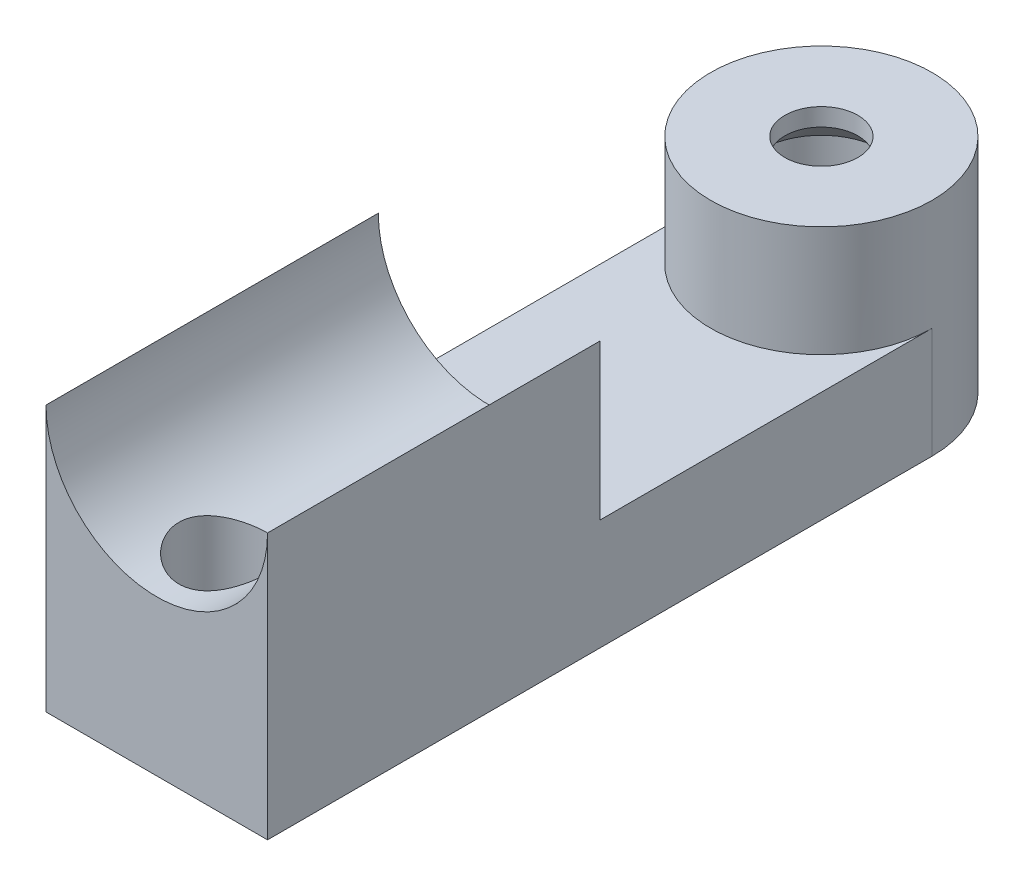
ISO-10303-21;
HEADER;
FILE_DESCRIPTION(('STEP AP214'),'2;1');
FILE_NAME('part.step','',(''),(''),'','','');
FILE_SCHEMA(('AUTOMOTIVE_DESIGN { 1 0 10303 214 1 1 1 1 }'));
ENDSEC;
DATA;
#1=APPLICATION_CONTEXT('core data for automotive mechanical design processes');
#2=APPLICATION_PROTOCOL_DEFINITION('international standard','automotive_design',2000,#1);
#3=PRODUCT_CONTEXT('',#1,'mechanical');
#4=PRODUCT('Part','Part','',(#3));
#5=PRODUCT_RELATED_PRODUCT_CATEGORY('part','',(#4));
#6=PRODUCT_DEFINITION_FORMATION('','',#4);
#7=PRODUCT_DEFINITION_CONTEXT('part definition',#1,'design');
#8=PRODUCT_DEFINITION('design','',#6,#7);
#9=PRODUCT_DEFINITION_SHAPE('','',#8);
#10=(LENGTH_UNIT() NAMED_UNIT(*) SI_UNIT(.MILLI.,.METRE.));
#11=(NAMED_UNIT(*) PLANE_ANGLE_UNIT() SI_UNIT($,.RADIAN.));
#12=(NAMED_UNIT(*) SI_UNIT($,.STERADIAN.) SOLID_ANGLE_UNIT());
#13=UNCERTAINTY_MEASURE_WITH_UNIT(LENGTH_MEASURE(1.E-05),#10,'distance_accuracy_value','');
#14=(GEOMETRIC_REPRESENTATION_CONTEXT(3) GLOBAL_UNCERTAINTY_ASSIGNED_CONTEXT((#13)) GLOBAL_UNIT_ASSIGNED_CONTEXT((#10,
#11,#12)) REPRESENTATION_CONTEXT('',''));
#15=CARTESIAN_POINT('',(0.,0.,0.));
#16=DIRECTION('',(0.,0.,1.));
#17=DIRECTION('',(1.,0.,0.));
#18=AXIS2_PLACEMENT_3D('',#15,#16,#17);
#19=CARTESIAN_POINT('',(0.,5.,0.));
#20=DIRECTION('',(0.,-1.,0.));
#21=DIRECTION('',(0.,0.,-1.));
#22=AXIS2_PLACEMENT_3D('',#19,#20,#21);
#23=CYLINDRICAL_SURFACE('',#22,1.65);
#24=CARTESIAN_POINT('',(0.,4.20000000000002,0.));
#25=DIRECTION('',(0.,-1.,0.));
#26=DIRECTION('',(0.,0.,-1.));
#27=AXIS2_PLACEMENT_3D('',#24,#25,#26);
#28=CIRCLE('',#27,1.65);
#29=CARTESIAN_POINT('',(0.,4.20000000000002,-1.65));
#30=VERTEX_POINT('',#29);
#31=EDGE_CURVE('E56',#30,#30,#28,.T.);
#32=ORIENTED_EDGE('',*,*,#31,.T.);
#33=EDGE_LOOP('',(#32));
#34=FACE_BOUND('',#33,.T.);
#35=CARTESIAN_POINT('',(0.,5.,0.));
#36=DIRECTION('',(0.,1.,0.));
#37=DIRECTION('',(0.,0.,1.));
#38=AXIS2_PLACEMENT_3D('',#35,#36,#37);
#39=CIRCLE('',#38,1.65);
#40=CARTESIAN_POINT('',(0.,5.,1.65));
#41=VERTEX_POINT('',#40);
#42=EDGE_CURVE('E136',#41,#41,#39,.T.);
#43=ORIENTED_EDGE('',*,*,#42,.T.);
#44=EDGE_LOOP('',(#43));
#45=FACE_BOUND('',#44,.T.);
#46=ADVANCED_FACE('F47',(#34,#45),#23,.F.);
#47=CARTESIAN_POINT('',(0.,0.,0.));
#48=DIRECTION('',(0.,-1.,0.));
#49=DIRECTION('',(0.,0.,-1.));
#50=AXIS2_PLACEMENT_3D('',#47,#48,#49);
#51=PLANE('',#50);
#52=DIRECTION('',(-1.,0.,0.));
#53=VECTOR('',#52,1.);
#54=CARTESIAN_POINT('',(0.,0.,15.));
#55=LINE('',#54,#53);
#56=CARTESIAN_POINT('',(5.,0.,15.));
#57=VERTEX_POINT('',#56);
#58=CARTESIAN_POINT('',(-5.,0.,15.));
#59=VERTEX_POINT('',#58);
#60=EDGE_CURVE('E94',#57,#59,#55,.T.);
#61=ORIENTED_EDGE('',*,*,#60,.F.);
#62=DIRECTION('',(0.,0.,1.));
#63=VECTOR('',#62,1.);
#64=CARTESIAN_POINT('',(5.,0.,30.));
#65=LINE('',#64,#63);
#66=CARTESIAN_POINT('',(5.,0.,0.));
#67=VERTEX_POINT('',#66);
#68=EDGE_CURVE('E128',#67,#57,#65,.T.);
#69=ORIENTED_EDGE('',*,*,#68,.F.);
#70=CARTESIAN_POINT('',(0.,0.,0.));
#71=DIRECTION('',(0.,1.,0.));
#72=DIRECTION('',(0.,0.,1.));
#73=AXIS2_PLACEMENT_3D('',#70,#71,#72);
#74=CIRCLE('',#73,5.);
#75=CARTESIAN_POINT('',(-5.,0.,0.));
#76=VERTEX_POINT('',#75);
#77=EDGE_CURVE('E139',#76,#67,#74,.T.);
#78=ORIENTED_EDGE('',*,*,#77,.F.);
#79=DIRECTION('',(0.,0.,-1.));
#80=VECTOR('',#79,1.);
#81=CARTESIAN_POINT('',(-5.,0.,0.));
#82=LINE('',#81,#80);
#83=EDGE_CURVE('E84',#59,#76,#82,.T.);
#84=ORIENTED_EDGE('',*,*,#83,.F.);
#85=EDGE_LOOP('',(#61,#69,#78,#84));
#86=FACE_BOUND('',#85,.T.);
#87=ADVANCED_FACE('F177',(#86),#51,.F.);
#88=CARTESIAN_POINT('',(0.,5.,0.));
#89=DIRECTION('',(0.,1.,0.));
#90=DIRECTION('',(0.,0.,1.));
#91=AXIS2_PLACEMENT_3D('',#88,#89,#90);
#92=PLANE('',#91);
#93=CARTESIAN_POINT('',(0.,5.,0.));
#94=DIRECTION('',(0.,1.,0.));
#95=DIRECTION('',(0.,0.,1.));
#96=AXIS2_PLACEMENT_3D('',#93,#94,#95);
#97=CIRCLE('',#96,5.);
#98=CARTESIAN_POINT('',(0.,5.,5.));
#99=VERTEX_POINT('',#98);
#100=EDGE_CURVE('E140',#99,#99,#97,.T.);
#101=ORIENTED_EDGE('',*,*,#100,.T.);
#102=EDGE_LOOP('',(#101));
#103=FACE_BOUND('',#102,.T.);
#104=ORIENTED_EDGE('',*,*,#42,.F.);
#105=EDGE_LOOP('',(#104));
#106=FACE_BOUND('',#105,.T.);
#107=ADVANCED_FACE('F184',(#103,#106),#92,.T.);
#108=CARTESIAN_POINT('',(0.,5.,0.));
#109=DIRECTION('',(0.,-1.,0.));
#110=DIRECTION('',(0.,0.,-1.));
#111=AXIS2_PLACEMENT_3D('',#108,#109,#110);
#112=CYLINDRICAL_SURFACE('',#111,5.);
#113=ORIENTED_EDGE('',*,*,#100,.F.);
#114=EDGE_LOOP('',(#113));
#115=FACE_BOUND('',#114,.T.);
#116=ORIENTED_EDGE('',*,*,#77,.T.);
#117=DIRECTION('',(0.,1.,0.));
#118=VECTOR('',#117,1.);
#119=CARTESIAN_POINT('',(5.,-5.,0.));
#120=LINE('',#119,#118);
#121=CARTESIAN_POINT('',(5.,-5.,0.));
#122=VERTEX_POINT('',#121);
#123=EDGE_CURVE('E63',#122,#67,#120,.T.);
#124=ORIENTED_EDGE('',*,*,#123,.F.);
#125=CARTESIAN_POINT('',(0.,-5.,0.));
#126=DIRECTION('',(0.,-1.,0.));
#127=DIRECTION('',(0.,0.,-1.));
#128=AXIS2_PLACEMENT_3D('',#125,#126,#127);
#129=CIRCLE('',#128,5.);
#130=CARTESIAN_POINT('',(-5.,-5.,0.));
#131=VERTEX_POINT('',#130);
#132=EDGE_CURVE('E106',#131,#122,#129,.T.);
#133=ORIENTED_EDGE('',*,*,#132,.F.);
#134=DIRECTION('',(0.,1.,0.));
#135=VECTOR('',#134,1.);
#136=CARTESIAN_POINT('',(-5.,-5.,0.));
#137=LINE('',#136,#135);
#138=EDGE_CURVE('E124',#131,#76,#137,.T.);
#139=ORIENTED_EDGE('',*,*,#138,.T.);
#140=EDGE_LOOP('',(#116,#124,#133,#139));
#141=FACE_BOUND('',#140,.T.);
#142=ADVANCED_FACE('F193',(#115,#141),#112,.T.);
#143=CARTESIAN_POINT('',(5.,-5.,30.));
#144=DIRECTION('',(-1.,0.,0.));
#145=DIRECTION('',(0.,0.,1.));
#146=AXIS2_PLACEMENT_3D('',#143,#144,#145);
#147=PLANE('',#146);
#148=DIRECTION('',(0.,1.,0.));
#149=VECTOR('',#148,1.);
#150=CARTESIAN_POINT('',(5.,-5.,30.));
#151=LINE('',#150,#149);
#152=CARTESIAN_POINT('',(5.,-5.,30.));
#153=VERTEX_POINT('',#152);
#154=CARTESIAN_POINT('',(5.,7.00000000000005,30.));
#155=VERTEX_POINT('',#154);
#156=EDGE_CURVE('E110',#153,#155,#151,.T.);
#157=ORIENTED_EDGE('',*,*,#156,.F.);
#158=DIRECTION('',(0.,0.,1.));
#159=VECTOR('',#158,1.);
#160=CARTESIAN_POINT('',(5.,-5.,30.));
#161=LINE('',#160,#159);
#162=EDGE_CURVE('E99',#122,#153,#161,.T.);
#163=ORIENTED_EDGE('',*,*,#162,.F.);
#164=ORIENTED_EDGE('',*,*,#123,.T.);
#165=ORIENTED_EDGE('',*,*,#68,.T.);
#166=DIRECTION('',(0.,1.,0.));
#167=VECTOR('',#166,1.);
#168=CARTESIAN_POINT('',(5.,-5.,15.));
#169=LINE('',#168,#167);
#170=CARTESIAN_POINT('',(5.,7.00000000000005,15.));
#171=VERTEX_POINT('',#170);
#172=EDGE_CURVE('E204',#57,#171,#169,.T.);
#173=ORIENTED_EDGE('',*,*,#172,.T.);
#174=DIRECTION('',(0.,0.,1.));
#175=VECTOR('',#174,1.);
#176=CARTESIAN_POINT('',(5.,7.00000000000005,15.));
#177=LINE('',#176,#175);
#178=EDGE_CURVE('E115',#171,#155,#177,.T.);
#179=ORIENTED_EDGE('',*,*,#178,.T.);
#180=EDGE_LOOP('',(#157,#163,#164,#165,#173,#179));
#181=FACE_BOUND('',#180,.T.);
#182=ADVANCED_FACE('F111',(#181),#147,.F.);
#183=CARTESIAN_POINT('',(-5.,-5.,30.));
#184=DIRECTION('',(0.,0.,-1.));
#185=DIRECTION('',(-1.,0.,0.));
#186=AXIS2_PLACEMENT_3D('',#183,#184,#185);
#187=PLANE('',#186);
#188=ORIENTED_EDGE('',*,*,#156,.T.);
#189=CARTESIAN_POINT('',(0.,7.00000000000002,30.));
#190=DIRECTION('',(0.,0.,-1.));
#191=DIRECTION('',(1.,0.,0.));
#192=AXIS2_PLACEMENT_3D('',#189,#190,#191);
#193=CIRCLE('',#192,4.99999999999996);
#194=CARTESIAN_POINT('',(-4.99999999999998,7.00000000000005,30.));
#195=VERTEX_POINT('',#194);
#196=EDGE_CURVE('E153',#155,#195,#193,.T.);
#197=ORIENTED_EDGE('',*,*,#196,.T.);
#198=DIRECTION('',(0.,1.,0.));
#199=VECTOR('',#198,1.);
#200=CARTESIAN_POINT('',(-5.,-5.,30.));
#201=LINE('',#200,#199);
#202=CARTESIAN_POINT('',(-5.,-5.,30.));
#203=VERTEX_POINT('',#202);
#204=EDGE_CURVE('E119',#203,#195,#201,.T.);
#205=ORIENTED_EDGE('',*,*,#204,.F.);
#206=DIRECTION('',(-1.,0.,0.));
#207=VECTOR('',#206,1.);
#208=CARTESIAN_POINT('',(-5.,-5.,30.));
#209=LINE('',#208,#207);
#210=EDGE_CURVE('E103',#153,#203,#209,.T.);
#211=ORIENTED_EDGE('',*,*,#210,.F.);
#212=EDGE_LOOP('',(#188,#197,#205,#211));
#213=FACE_BOUND('',#212,.T.);
#214=ADVANCED_FACE('F121',(#213),#187,.F.);
#215=CARTESIAN_POINT('',(-5.,-5.,0.));
#216=DIRECTION('',(1.,0.,0.));
#217=DIRECTION('',(0.,0.,-1.));
#218=AXIS2_PLACEMENT_3D('',#215,#216,#217);
#219=PLANE('',#218);
#220=ORIENTED_EDGE('',*,*,#204,.T.);
#221=DIRECTION('',(0.,0.,1.));
#222=VECTOR('',#221,1.);
#223=CARTESIAN_POINT('',(-4.99999999999998,7.00000000000005,15.));
#224=LINE('',#223,#222);
#225=CARTESIAN_POINT('',(-4.99999999999998,7.00000000000005,15.));
#226=VERTEX_POINT('',#225);
#227=EDGE_CURVE('E130',#226,#195,#224,.T.);
#228=ORIENTED_EDGE('',*,*,#227,.F.);
#229=DIRECTION('',(0.,-1.,0.));
#230=VECTOR('',#229,1.);
#231=CARTESIAN_POINT('',(-5.,0.,15.));
#232=LINE('',#231,#230);
#233=EDGE_CURVE('E213',#226,#59,#232,.T.);
#234=ORIENTED_EDGE('',*,*,#233,.T.);
#235=ORIENTED_EDGE('',*,*,#83,.T.);
#236=ORIENTED_EDGE('',*,*,#138,.F.);
#237=DIRECTION('',(0.,0.,-1.));
#238=VECTOR('',#237,1.);
#239=CARTESIAN_POINT('',(-5.,-5.,0.));
#240=LINE('',#239,#238);
#241=EDGE_CURVE('E72',#203,#131,#240,.T.);
#242=ORIENTED_EDGE('',*,*,#241,.F.);
#243=EDGE_LOOP('',(#220,#228,#234,#235,#236,#242));
#244=FACE_BOUND('',#243,.T.);
#245=ADVANCED_FACE('F174',(#244),#219,.F.);
#246=CARTESIAN_POINT('',(0.,-5.,0.));
#247=DIRECTION('',(0.,-1.,0.));
#248=DIRECTION('',(0.,0.,-1.));
#249=AXIS2_PLACEMENT_3D('',#246,#247,#248);
#250=PLANE('',#249);
#251=CARTESIAN_POINT('',(0.,-5.,0.));
#252=DIRECTION('',(0.,-1.,0.));
#253=DIRECTION('',(0.,0.,-1.));
#254=AXIS2_PLACEMENT_3D('',#251,#252,#253);
#255=CIRCLE('',#254,2.75);
#256=CARTESIAN_POINT('',(0.,-5.,-2.75));
#257=VERTEX_POINT('',#256);
#258=EDGE_CURVE('E388',#257,#257,#255,.T.);
#259=ORIENTED_EDGE('',*,*,#258,.F.);
#260=EDGE_LOOP('',(#259));
#261=FACE_BOUND('',#260,.T.);
#262=ORIENTED_EDGE('',*,*,#241,.T.);
#263=ORIENTED_EDGE('',*,*,#132,.T.);
#264=ORIENTED_EDGE('',*,*,#162,.T.);
#265=ORIENTED_EDGE('',*,*,#210,.T.);
#266=EDGE_LOOP('',(#262,#263,#264,#265));
#267=FACE_BOUND('',#266,.T.);
#268=ADVANCED_FACE('F101',(#261,#267),#250,.T.);
#269=CARTESIAN_POINT('',(0.,7.00000000000002,15.));
#270=DIRECTION('',(0.,0.,1.));
#271=DIRECTION('',(1.,0.,0.));
#272=AXIS2_PLACEMENT_3D('',#269,#270,#271);
#273=PLANE('',#272);
#274=ORIENTED_EDGE('',*,*,#172,.F.);
#275=ORIENTED_EDGE('',*,*,#60,.T.);
#276=ORIENTED_EDGE('',*,*,#233,.F.);
#277=CARTESIAN_POINT('',(0.,7.00000000000002,15.));
#278=DIRECTION('',(0.,0.,-1.));
#279=DIRECTION('',(1.,0.,0.));
#280=AXIS2_PLACEMENT_3D('',#277,#278,#279);
#281=CIRCLE('',#280,4.99999999999996);
#282=EDGE_CURVE('E208',#171,#226,#281,.T.);
#283=ORIENTED_EDGE('',*,*,#282,.F.);
#284=EDGE_LOOP('',(#274,#275,#276,#283));
#285=FACE_BOUND('',#284,.T.);
#286=ADVANCED_FACE('F166',(#285),#273,.F.);
#287=CARTESIAN_POINT('',(0.,7.00000000000002,15.));
#288=DIRECTION('',(0.,0.,1.));
#289=DIRECTION('',(1.,0.,0.));
#290=AXIS2_PLACEMENT_3D('',#287,#288,#289);
#291=CYLINDRICAL_SURFACE('',#290,4.99999999999996);
#292=CARTESIAN_POINT('',(0.,2.00000000000005,25.));
#293=CARTESIAN_POINT('',(-0.107493005442891,2.00000728772921,25.0000098518237));
#294=CARTESIAN_POINT('',(-0.215172564090673,2.00350705693073,25.0087177520884));
#295=CARTESIAN_POINT('',(-0.427496480417896,2.01716546899364,25.0432477035212));
#296=CARTESIAN_POINT('',(-0.532131777561248,2.02734221301128,25.0691162790861));
#297=CARTESIAN_POINT('',(-0.734953922727403,2.05325790786887,25.1368760780588));
#298=CARTESIAN_POINT('',(-0.833160661616958,2.06897863635933,25.1787148462167));
#299=CARTESIAN_POINT('',(-1.02107197032837,2.10443389203927,25.2770191733265));
#300=CARTESIAN_POINT('',(-1.11077947675099,2.12416702541948,25.3334796549189));
#301=CARTESIAN_POINT('',(-1.28350100757039,2.16669113829586,25.4622354985609));
#302=CARTESIAN_POINT('',(-1.36606227255021,2.18957703070814,25.5351066562403));
#303=CARTESIAN_POINT('',(-1.51817500478472,2.2353942309381,25.6934000034768));
#304=CARTESIAN_POINT('',(-1.58772010713353,2.25832555546212,25.7788282972117));
#305=CARTESIAN_POINT('',(-1.71487456729288,2.30277208202868,25.9644280702423));
#306=CARTESIAN_POINT('',(-1.77181498119547,2.32417884035053,26.0650864860232));
#307=CARTESIAN_POINT('',(-1.86775471903715,2.36166352813212,26.27553639842));
#308=CARTESIAN_POINT('',(-1.90676256428583,2.37774398755829,26.3853235278484));
#309=CARTESIAN_POINT('',(-1.96389882339587,2.40173642339186,26.6057123335921));
#310=CARTESIAN_POINT('',(-1.98289396580565,2.409985796444,26.7160512355762));
#311=CARTESIAN_POINT('',(-2.00217296164003,2.41835995950861,26.9386349983073));
#312=CARTESIAN_POINT('',(-2.00246601631322,2.41848874477237,27.050878894625));
#313=CARTESIAN_POINT('',(-1.98498936750455,2.41089499720011,27.265756671458));
#314=CARTESIAN_POINT('',(-1.96847531430514,2.40371824961555,27.368515714409));
#315=CARTESIAN_POINT('',(-1.91994688029782,2.38323812392169,27.5696595560067));
#316=CARTESIAN_POINT('',(-1.88792979480463,2.36993367678332,27.6680435881103));
#317=CARTESIAN_POINT('',(-1.80869473255107,2.33840514911475,27.860017836196));
#318=CARTESIAN_POINT('',(-1.76117986231532,2.32008620719217,27.9534692390547));
#319=CARTESIAN_POINT('',(-1.65250646073221,2.28061883610115,28.1314158163616));
#320=CARTESIAN_POINT('',(-1.59134280510084,2.25946934543157,28.2159076094028));
#321=CARTESIAN_POINT('',(-1.45155059945443,2.21473263257734,28.380409728802));
#322=CARTESIAN_POINT('',(-1.37193746297064,2.19108335023853,28.459568729446));
#323=CARTESIAN_POINT('',(-1.20031442743019,2.14540175041723,28.603684478002));
#324=CARTESIAN_POINT('',(-1.10830206533444,2.1233697555468,28.6686383974103));
#325=CARTESIAN_POINT('',(-0.912077652605844,2.08285318735457,28.7836174474158));
#326=CARTESIAN_POINT('',(-0.807660491346479,2.0644472990459,28.8333222811971));
#327=CARTESIAN_POINT('',(-0.591023765482883,2.03385171671246,28.9141678610781));
#328=CARTESIAN_POINT('',(-0.478808196849675,2.02165886537623,28.9453180375574));
#329=CARTESIAN_POINT('',(-0.256895887607821,2.00543860493095,28.9864482954197));
#330=CARTESIAN_POINT('',(-0.147443293985536,2.00097054166491,28.9975724542536));
#331=CARTESIAN_POINT('',(0.0718453098078158,1.99931521489375,29.0017131005286));
#332=CARTESIAN_POINT('',(0.181681213223923,2.00212606417714,28.9947342815475));
#333=CARTESIAN_POINT('',(0.393432739121986,2.01442432936253,28.963708247448));
#334=CARTESIAN_POINT('',(0.495482491775473,2.02360608654482,28.940442019649));
#335=CARTESIAN_POINT('',(0.694135428060778,2.04740558594506,28.8785642916902));
#336=CARTESIAN_POINT('',(0.790737910224843,2.06202402643475,28.8399508203313));
#337=CARTESIAN_POINT('',(0.9790787858167,2.09583405229194,28.7472150603201));
#338=CARTESIAN_POINT('',(1.0705780227554,2.11515184020202,28.6926545279569));
#339=CARTESIAN_POINT('',(1.24344359124655,2.15626635254481,28.5700596760944));
#340=CARTESIAN_POINT('',(1.32480584076112,2.17806406889736,28.5020199570774));
#341=CARTESIAN_POINT('',(1.48072304302882,2.22354882361894,28.3491299870504));
#342=CARTESIAN_POINT('',(1.55447393380606,2.24726558574954,28.2634664584938));
#343=CARTESIAN_POINT('',(1.68675119741371,2.29258327082874,28.0805599169906));
#344=CARTESIAN_POINT('',(1.74527506133751,2.31418384473496,27.9833149996601));
#345=CARTESIAN_POINT('',(1.84580750193163,2.35285700092298,27.7785383054059));
#346=CARTESIAN_POINT('',(1.88765059453445,2.36988369115219,27.6709160007877));
#347=CARTESIAN_POINT('',(1.9522962197053,2.39676326522075,27.4492663482848));
#348=CARTESIAN_POINT('',(1.97511280526932,2.40662144304008,27.3352437941876));
#349=CARTESIAN_POINT('',(1.9997156172784,2.4172824070008,27.1128720982255));
#350=CARTESIAN_POINT('',(2.00289708230287,2.41868578991835,27.0047051604067));
#351=CARTESIAN_POINT('',(1.99180315927753,2.41385163966909,26.7894551422867));
#352=CARTESIAN_POINT('',(1.97752998791378,2.40761507675213,26.6823719260974));
#353=CARTESIAN_POINT('',(1.93307136615365,2.38873350920986,26.476667810145));
#354=CARTESIAN_POINT('',(1.90353749357098,2.37635168172557,26.377879725567));
#355=CARTESIAN_POINT('',(1.83000544849102,2.3467599876731,26.1866213703865));
#356=CARTESIAN_POINT('',(1.78600328139382,2.32954878794,26.0941528531002));
#357=CARTESIAN_POINT('',(1.68187276275973,2.29101390395515,25.9123903807292));
#358=CARTESIAN_POINT('',(1.62096533515949,2.26951117686764,25.8235813298695));
#359=CARTESIAN_POINT('',(1.4858921192715,2.22536195627769,25.6570066827962));
#360=CARTESIAN_POINT('',(1.41172233481813,2.202715119516,25.5792444278717));
#361=CARTESIAN_POINT('',(1.24650550627247,2.15706432912612,25.4317971467364));
#362=CARTESIAN_POINT('',(1.15467600114614,2.13413242037821,25.3629626931019));
#363=CARTESIAN_POINT('',(0.959900320285784,2.09199593286289,25.2416629573784));
#364=CARTESIAN_POINT('',(0.856949004547242,2.072793089071,25.1892052878475));
#365=CARTESIAN_POINT('',(0.644738062495208,2.04060285184144,25.1033777848097));
#366=CARTESIAN_POINT('',(0.535631618219701,2.02750636944978,25.0696706764397));
#367=CARTESIAN_POINT('',(0.312876546281225,2.0085569379064,25.0213608790457));
#368=CARTESIAN_POINT('',(0.199243525858917,2.00268100504368,25.0066975632561));
#369=CARTESIAN_POINT('',(0.0569122978909329,2.00024100495869,25.0006046190217));
#370=CARTESIAN_POINT('',(0.02846268874076,1.9999980703083,24.9999973913708));
#371=CARTESIAN_POINT('',(0.,2.00000000000005,25.));
#372=B_SPLINE_CURVE_WITH_KNOTS('',3,(#292,#293,#294,#295,#296,#297,#298,#299,#300,#301,#302,
#303,#304,#305,#306,#307,#308,#309,#310,#311,#312,#313,#314,#315,#316,#317,#318,#319,#320,#321,
#322,#323,#324,#325,#326,#327,#328,#329,#330,#331,#332,#333,#334,#335,#336,#337,#338,#339,#340,
#341,#342,#343,#344,#345,#346,#347,#348,#349,#350,#351,#352,#353,#354,#355,#356,#357,#358,#359,
#360,#361,#362,#363,#364,#365,#366,#367,#368,#369,#370,#371),.UNSPECIFIED.,.T.,.F.,(4,2,2,2,2,2,
2,2,2,2,2,2,2,2,2,2,2,2,2,2,2,2,2,2,2,2,2,2,2,2,2,2,2,2,2,2,2,2,2,4),(0.,0.322402987893071,
0.645683636007934,0.96791145747158,1.29002753567984,1.62597381700397,1.96208394934411,
2.31315258819217,2.66405423118268,2.99904105308828,3.33386306340488,3.64538328401372,
3.95695787256048,4.27489126298816,4.59294421938183,4.93558349186557,5.27829092839733,
5.62776913162806,5.9770695611379,6.30569184528007,6.63422893570082,6.94800455564365,
7.26182048993796,7.58523513398262,7.90877959498969,8.25368474624413,8.59864669043748,
8.94695045140827,9.29499672645934,9.61799673392748,9.94095572563046,10.2511431854877,
10.5614163580516,10.8894546805669,11.2175920134839,11.5670042353384,11.9165786364053,
12.2596430101332,12.6016125240434,12.686980458968),.UNSPECIFIED.);
#373=CARTESIAN_POINT('',(0.,2.00000000000005,25.));
#374=VERTEX_POINT('',#373);
#375=EDGE_CURVE('E146',#374,#374,#372,.T.);
#376=ORIENTED_EDGE('',*,*,#375,.F.);
#377=EDGE_LOOP('',(#376));
#378=FACE_BOUND('',#377,.T.);
#379=ORIENTED_EDGE('',*,*,#196,.F.);
#380=ORIENTED_EDGE('',*,*,#178,.F.);
#381=ORIENTED_EDGE('',*,*,#282,.T.);
#382=ORIENTED_EDGE('',*,*,#227,.T.);
#383=EDGE_LOOP('',(#379,#380,#381,#382));
#384=FACE_BOUND('',#383,.T.);
#385=ADVANCED_FACE('F155',(#378,#384),#291,.F.);
#386=CARTESIAN_POINT('',(0.,7.00000000000005,27.));
#387=DIRECTION('',(0.,-1.,0.));
#388=DIRECTION('',(0.,0.,-1.));
#389=AXIS2_PLACEMENT_3D('',#386,#387,#388);
#390=CYLINDRICAL_SURFACE('',#389,2.);
#391=ORIENTED_EDGE('',*,*,#375,.T.);
#392=EDGE_LOOP('',(#391));
#393=FACE_BOUND('',#392,.T.);
#394=CARTESIAN_POINT('',(0.,-3.1,27.));
#395=DIRECTION('',(0.,-1.,0.));
#396=DIRECTION('',(0.,0.,-1.));
#397=AXIS2_PLACEMENT_3D('',#394,#395,#396);
#398=CIRCLE('',#397,2.);
#399=CARTESIAN_POINT('',(0.,-3.1,25.));
#400=VERTEX_POINT('',#399);
#401=EDGE_CURVE('E154',#400,#400,#398,.T.);
#402=ORIENTED_EDGE('',*,*,#401,.T.);
#403=EDGE_LOOP('',(#402));
#404=FACE_BOUND('',#403,.T.);
#405=ADVANCED_FACE('F159',(#393,#404),#390,.F.);
#406=CARTESIAN_POINT('',(0.,-3.1,27.));
#407=DIRECTION('',(0.,-1.,0.));
#408=DIRECTION('',(0.,0.,-1.));
#409=AXIS2_PLACEMENT_3D('',#406,#407,#408);
#410=PLANE('',#409);
#411=ORIENTED_EDGE('',*,*,#401,.F.);
#412=EDGE_LOOP('',(#411));
#413=FACE_BOUND('',#412,.T.);
#414=ADVANCED_FACE('F163',(#413),#410,.F.);
#415=CARTESIAN_POINT('',(0.,3.,0.));
#416=DIRECTION('',(0.,-1.,0.));
#417=DIRECTION('',(0.,0.,-1.));
#418=AXIS2_PLACEMENT_3D('',#415,#416,#417);
#419=CYLINDRICAL_SURFACE('',#418,2.75);
#420=CARTESIAN_POINT('',(0.,3.10000000000001,0.));
#421=DIRECTION('',(0.,-1.,0.));
#422=DIRECTION('',(0.,0.,-1.));
#423=AXIS2_PLACEMENT_3D('',#420,#421,#422);
#424=CIRCLE('',#423,2.75);
#425=CARTESIAN_POINT('',(0.,3.10000000000001,-2.75));
#426=VERTEX_POINT('',#425);
#427=EDGE_CURVE('E11',#426,#426,#424,.F.);
#428=ORIENTED_EDGE('',*,*,#427,.T.);
#429=EDGE_LOOP('',(#428));
#430=FACE_BOUND('',#429,.T.);
#431=ORIENTED_EDGE('',*,*,#258,.T.);
#432=EDGE_LOOP('',(#431));
#433=FACE_BOUND('',#432,.T.);
#434=ADVANCED_FACE('F256',(#430,#433),#419,.F.);
#435=CARTESIAN_POINT('',(0.,4.20000000000002,0.));
#436=DIRECTION('',(0.,-1.,0.));
#437=DIRECTION('',(0.,0.,-1.));
#438=AXIS2_PLACEMENT_3D('',#435,#436,#437);
#439=CONICAL_SURFACE('',#438,1.65,0.785398163397443);
#440=ORIENTED_EDGE('',*,*,#427,.F.);
#441=EDGE_LOOP('',(#440));
#442=FACE_BOUND('',#441,.T.);
#443=ORIENTED_EDGE('',*,*,#31,.F.);
#444=EDGE_LOOP('',(#443));
#445=FACE_BOUND('',#444,.T.);
#446=ADVANCED_FACE('F50',(#442,#445),#439,.F.);
#447=CLOSED_SHELL('',(#46,#87,#107,#142,#182,#214,#245,#268,#286,#385,#405,#414,#434,#446));
#448=MANIFOLD_SOLID_BREP('B2',#447);
#449=ADVANCED_BREP_SHAPE_REPRESENTATION('',(#18,#448),#14);
#450=SHAPE_DEFINITION_REPRESENTATION(#9,#449);
ENDSEC;
END-ISO-10303-21;
